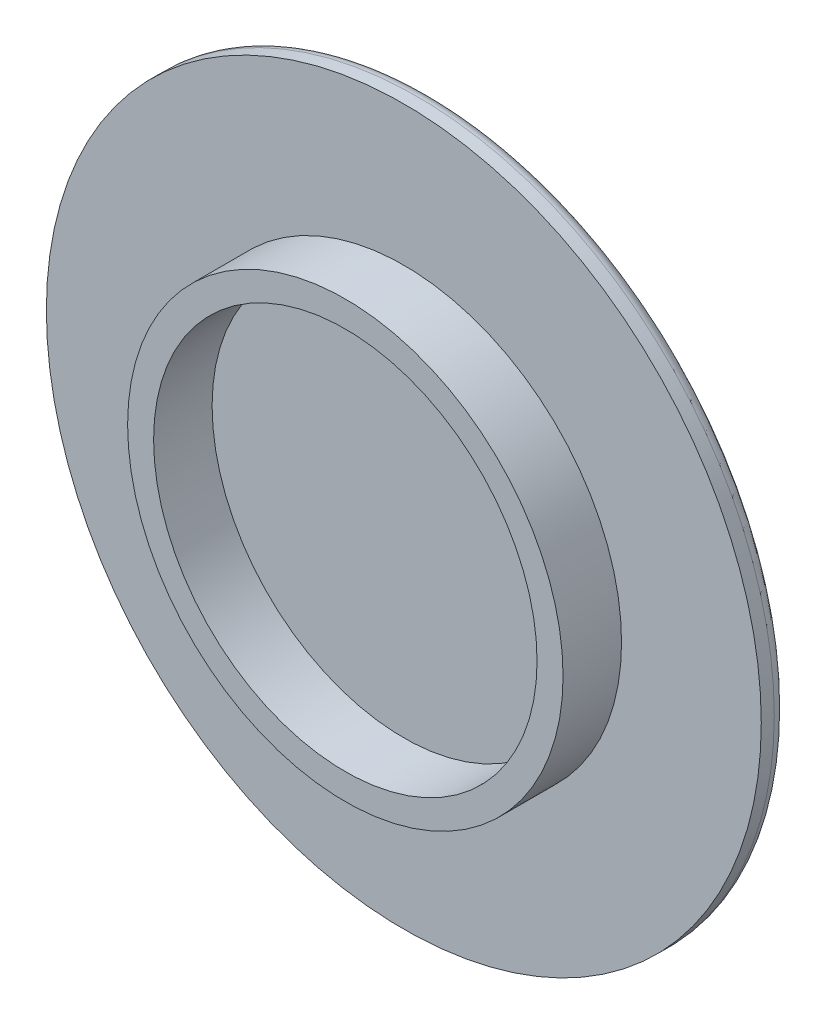
ISO-10303-21;
HEADER;
FILE_DESCRIPTION(('STEP AP214'),'2;1');
FILE_NAME('part.step','',(''),(''),'','','');
FILE_SCHEMA(('AUTOMOTIVE_DESIGN { 1 0 10303 214 1 1 1 1 }'));
ENDSEC;
DATA;
#1=APPLICATION_CONTEXT('core data for automotive mechanical design processes');
#2=APPLICATION_PROTOCOL_DEFINITION('international standard','automotive_design',2000,#1);
#3=PRODUCT_CONTEXT('',#1,'mechanical');
#4=PRODUCT('Part','Part','',(#3));
#5=PRODUCT_RELATED_PRODUCT_CATEGORY('part','',(#4));
#6=PRODUCT_DEFINITION_FORMATION('','',#4);
#7=PRODUCT_DEFINITION_CONTEXT('part definition',#1,'design');
#8=PRODUCT_DEFINITION('design','',#6,#7);
#9=PRODUCT_DEFINITION_SHAPE('','',#8);
#10=(LENGTH_UNIT() NAMED_UNIT(*) SI_UNIT(.MILLI.,.METRE.));
#11=(NAMED_UNIT(*) PLANE_ANGLE_UNIT() SI_UNIT($,.RADIAN.));
#12=(NAMED_UNIT(*) SI_UNIT($,.STERADIAN.) SOLID_ANGLE_UNIT());
#13=UNCERTAINTY_MEASURE_WITH_UNIT(LENGTH_MEASURE(1.E-05),#10,'distance_accuracy_value','');
#14=(GEOMETRIC_REPRESENTATION_CONTEXT(3) GLOBAL_UNCERTAINTY_ASSIGNED_CONTEXT((#13)) GLOBAL_UNIT_ASSIGNED_CONTEXT((#10,
#11,#12)) REPRESENTATION_CONTEXT('',''));
#15=CARTESIAN_POINT('',(0.,0.,0.));
#16=DIRECTION('',(0.,0.,1.));
#17=DIRECTION('',(1.,0.,0.));
#18=AXIS2_PLACEMENT_3D('',#15,#16,#17);
#19=CARTESIAN_POINT('',(0.,0.,4.5));
#20=DIRECTION('',(0.,0.,1.));
#21=DIRECTION('',(1.,0.,0.));
#22=AXIS2_PLACEMENT_3D('',#19,#20,#21);
#23=PLANE('',#22);
#24=CARTESIAN_POINT('',(0.,0.,4.5));
#25=DIRECTION('',(0.,0.,1.));
#26=DIRECTION('',(1.,0.,0.));
#27=AXIS2_PLACEMENT_3D('',#24,#25,#26);
#28=CIRCLE('',#27,16.75);
#29=CARTESIAN_POINT('',(16.75,0.,4.5));
#30=VERTEX_POINT('',#29);
#31=EDGE_CURVE('E42',#30,#30,#28,.T.);
#32=ORIENTED_EDGE('',*,*,#31,.T.);
#33=EDGE_LOOP('',(#32));
#34=FACE_BOUND('',#33,.T.);
#35=CARTESIAN_POINT('',(0.,0.,4.5));
#36=DIRECTION('',(0.,0.,1.));
#37=DIRECTION('',(1.,0.,0.));
#38=AXIS2_PLACEMENT_3D('',#35,#36,#37);
#39=CIRCLE('',#38,14.75);
#40=CARTESIAN_POINT('',(14.75,0.,4.5));
#41=VERTEX_POINT('',#40);
#42=EDGE_CURVE('E46',#41,#41,#39,.T.);
#43=ORIENTED_EDGE('',*,*,#42,.F.);
#44=EDGE_LOOP('',(#43));
#45=FACE_BOUND('',#44,.T.);
#46=ADVANCED_FACE('F31',(#34,#45),#23,.T.);
#47=CARTESIAN_POINT('',(0.,0.,4.5));
#48=DIRECTION('',(0.,0.,-1.));
#49=DIRECTION('',(-1.,0.,0.));
#50=AXIS2_PLACEMENT_3D('',#47,#48,#49);
#51=CYLINDRICAL_SURFACE('',#50,16.75);
#52=ORIENTED_EDGE('',*,*,#31,.F.);
#53=EDGE_LOOP('',(#52));
#54=FACE_BOUND('',#53,.T.);
#55=CARTESIAN_POINT('',(0.,0.,0.));
#56=DIRECTION('',(0.,0.,1.));
#57=DIRECTION('',(1.,0.,0.));
#58=AXIS2_PLACEMENT_3D('',#55,#56,#57);
#59=CIRCLE('',#58,16.75);
#60=CARTESIAN_POINT('',(16.75,0.,0.));
#61=VERTEX_POINT('',#60);
#62=EDGE_CURVE('E49',#61,#61,#59,.T.);
#63=ORIENTED_EDGE('',*,*,#62,.T.);
#64=EDGE_LOOP('',(#63));
#65=FACE_BOUND('',#64,.T.);
#66=ADVANCED_FACE('F81',(#54,#65),#51,.T.);
#67=CARTESIAN_POINT('',(0.,0.,4.5));
#68=DIRECTION('',(0.,0.,-1.));
#69=DIRECTION('',(-1.,0.,0.));
#70=AXIS2_PLACEMENT_3D('',#67,#68,#69);
#71=CYLINDRICAL_SURFACE('',#70,14.75);
#72=ORIENTED_EDGE('',*,*,#42,.T.);
#73=EDGE_LOOP('',(#72));
#74=FACE_BOUND('',#73,.T.);
#75=CARTESIAN_POINT('',(0.,0.,0.));
#76=DIRECTION('',(0.,0.,1.));
#77=DIRECTION('',(1.,0.,0.));
#78=AXIS2_PLACEMENT_3D('',#75,#76,#77);
#79=CIRCLE('',#78,14.75);
#80=CARTESIAN_POINT('',(14.75,0.,0.));
#81=VERTEX_POINT('',#80);
#82=EDGE_CURVE('E51',#81,#81,#79,.T.);
#83=ORIENTED_EDGE('',*,*,#82,.F.);
#84=EDGE_LOOP('',(#83));
#85=FACE_BOUND('',#84,.T.);
#86=ADVANCED_FACE('F78',(#74,#85),#71,.F.);
#87=CARTESIAN_POINT('',(0.,0.,0.));
#88=DIRECTION('',(0.,0.,-1.));
#89=DIRECTION('',(-1.,0.,0.));
#90=AXIS2_PLACEMENT_3D('',#87,#88,#89);
#91=PLANE('',#90);
#92=ORIENTED_EDGE('',*,*,#82,.T.);
#93=EDGE_LOOP('',(#92));
#94=FACE_BOUND('',#93,.T.);
#95=ADVANCED_FACE('F68',(#94),#91,.F.);
#96=CARTESIAN_POINT('',(0.,0.,-2.));
#97=DIRECTION('',(0.,0.,1.));
#98=DIRECTION('',(1.,0.,0.));
#99=AXIS2_PLACEMENT_3D('',#96,#97,#98);
#100=CYLINDRICAL_SURFACE('',#99,27.5);
#101=CARTESIAN_POINT('',(0.,0.,-1.));
#102=DIRECTION('',(0.,0.,-1.));
#103=DIRECTION('',(-1.,0.,0.));
#104=AXIS2_PLACEMENT_3D('',#101,#102,#103);
#105=CIRCLE('',#104,27.5);
#106=CARTESIAN_POINT('',(-27.5,0.,-1.));
#107=VERTEX_POINT('',#106);
#108=EDGE_CURVE('E10',#107,#107,#105,.F.);
#109=ORIENTED_EDGE('',*,*,#108,.T.);
#110=EDGE_LOOP('',(#109));
#111=FACE_BOUND('',#110,.T.);
#112=CARTESIAN_POINT('',(0.,0.,0.));
#113=DIRECTION('',(0.,0.,-1.));
#114=DIRECTION('',(-1.,0.,0.));
#115=AXIS2_PLACEMENT_3D('',#112,#113,#114);
#116=CIRCLE('',#115,27.5);
#117=CARTESIAN_POINT('',(-27.5,0.,0.));
#118=VERTEX_POINT('',#117);
#119=EDGE_CURVE('E52',#118,#118,#116,.T.);
#120=ORIENTED_EDGE('',*,*,#119,.T.);
#121=EDGE_LOOP('',(#120));
#122=FACE_BOUND('',#121,.T.);
#123=ADVANCED_FACE('F61',(#111,#122),#100,.T.);
#124=CARTESIAN_POINT('',(0.,0.,-2.));
#125=DIRECTION('',(0.,0.,-1.));
#126=DIRECTION('',(-1.,0.,0.));
#127=AXIS2_PLACEMENT_3D('',#124,#125,#126);
#128=PLANE('',#127);
#129=CARTESIAN_POINT('',(0.,0.,-2.));
#130=DIRECTION('',(0.,0.,-1.));
#131=DIRECTION('',(-1.,0.,0.));
#132=AXIS2_PLACEMENT_3D('',#129,#130,#131);
#133=CIRCLE('',#132,26.5);
#134=CARTESIAN_POINT('',(-26.5,0.,-2.));
#135=VERTEX_POINT('',#134);
#136=EDGE_CURVE('E38',#135,#135,#133,.T.);
#137=ORIENTED_EDGE('',*,*,#136,.T.);
#138=EDGE_LOOP('',(#137));
#139=FACE_BOUND('',#138,.T.);
#140=ADVANCED_FACE('F65',(#139),#128,.T.);
#141=ORIENTED_EDGE('',*,*,#62,.F.);
#142=EDGE_LOOP('',(#141));
#143=FACE_BOUND('',#142,.T.);
#144=ORIENTED_EDGE('',*,*,#119,.F.);
#145=EDGE_LOOP('',(#144));
#146=FACE_BOUND('',#145,.T.);
#147=ADVANCED_FACE('F63',(#143,#146),#91,.F.);
#148=CARTESIAN_POINT('',(0.,0.,-1.));
#149=DIRECTION('',(0.,0.,-1.));
#150=DIRECTION('',(-1.,0.,0.));
#151=AXIS2_PLACEMENT_3D('',#148,#149,#150);
#152=TOROIDAL_SURFACE('',#151,26.5,1.);
#153=ORIENTED_EDGE('',*,*,#108,.F.);
#154=EDGE_LOOP('',(#153));
#155=FACE_BOUND('',#154,.T.);
#156=ORIENTED_EDGE('',*,*,#136,.F.);
#157=EDGE_LOOP('',(#156));
#158=FACE_BOUND('',#157,.T.);
#159=ADVANCED_FACE('F33',(#155,#158),#152,.T.);
#160=CLOSED_SHELL('',(#46,#66,#86,#95,#123,#140,#147,#159));
#161=MANIFOLD_SOLID_BREP('B2',#160);
#162=ADVANCED_BREP_SHAPE_REPRESENTATION('',(#18,#161),#14);
#163=SHAPE_DEFINITION_REPRESENTATION(#9,#162);
ENDSEC;
END-ISO-10303-21;
